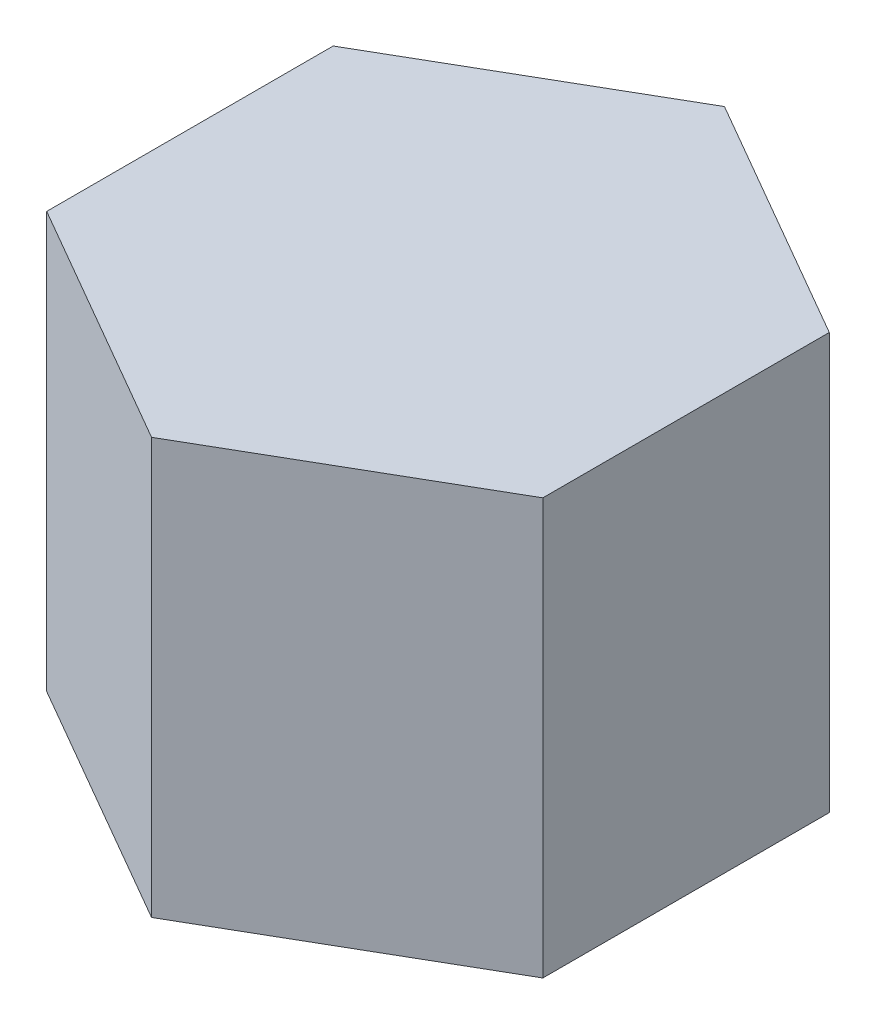
ISO-10303-21;
HEADER;
FILE_DESCRIPTION(('STEP AP214'),'2;1');
FILE_NAME('part.step','',(''),(''),'','','');
FILE_SCHEMA(('AUTOMOTIVE_DESIGN { 1 0 10303 214 1 1 1 1 }'));
ENDSEC;
DATA;
#1=APPLICATION_CONTEXT('core data for automotive mechanical design processes');
#2=APPLICATION_PROTOCOL_DEFINITION('international standard','automotive_design',2000,#1);
#3=PRODUCT_CONTEXT('',#1,'mechanical');
#4=PRODUCT('Part','Part','',(#3));
#5=PRODUCT_RELATED_PRODUCT_CATEGORY('part','',(#4));
#6=PRODUCT_DEFINITION_FORMATION('','',#4);
#7=PRODUCT_DEFINITION_CONTEXT('part definition',#1,'design');
#8=PRODUCT_DEFINITION('design','',#6,#7);
#9=PRODUCT_DEFINITION_SHAPE('','',#8);
#10=(LENGTH_UNIT() NAMED_UNIT(*) SI_UNIT(.MILLI.,.METRE.));
#11=(NAMED_UNIT(*) PLANE_ANGLE_UNIT() SI_UNIT($,.RADIAN.));
#12=(NAMED_UNIT(*) SI_UNIT($,.STERADIAN.) SOLID_ANGLE_UNIT());
#13=UNCERTAINTY_MEASURE_WITH_UNIT(LENGTH_MEASURE(1.E-05),#10,'distance_accuracy_value','');
#14=(GEOMETRIC_REPRESENTATION_CONTEXT(3) GLOBAL_UNCERTAINTY_ASSIGNED_CONTEXT((#13)) GLOBAL_UNIT_ASSIGNED_CONTEXT((#10,
#11,#12)) REPRESENTATION_CONTEXT('',''));
#15=CARTESIAN_POINT('',(0.,0.,0.));
#16=DIRECTION('',(0.,0.,1.));
#17=DIRECTION('',(1.,0.,0.));
#18=AXIS2_PLACEMENT_3D('',#15,#16,#17);
#19=CARTESIAN_POINT('',(209.642660308706,-148.537700895744,289.774920412926));
#20=DIRECTION('',(-0.499999999999943,0.,-0.866025403784472));
#21=DIRECTION('',(-0.866025403784472,0.,0.499999999999943));
#22=AXIS2_PLACEMENT_3D('',#19,#20,#21);
#23=PLANE('',#22);
#24=CARTESIAN_POINT('',(209.339551417382,-149.045793579175,289.949920412926));
#25=DIRECTION('',(0.866025403784471,0.,-0.499999999999943));
#26=VECTOR('',#25,1.);
#27=LINE('',#24,#26);
#28=CARTESIAN_POINT('',(209.339551417382,-149.045793579175,289.949920412926));
#29=VERTEX_POINT('',#28);
#30=CARTESIAN_POINT('',(209.642660308706,-149.045793579175,289.774920412926));
#31=VERTEX_POINT('',#30);
#32=EDGE_CURVE('E170',#29,#31,#27,.T.);
#33=ORIENTED_EDGE('',*,*,#32,.T.);
#34=CARTESIAN_POINT('',(209.642660308706,-148.537700895744,289.774920412926));
#35=DIRECTION('',(0.,-1.,0.));
#36=VECTOR('',#35,1.);
#37=LINE('',#34,#36);
#38=CARTESIAN_POINT('',(209.642660308706,-148.537700895744,289.774920412926));
#39=VERTEX_POINT('',#38);
#40=EDGE_CURVE('E35',#39,#31,#37,.T.);
#41=ORIENTED_EDGE('',*,*,#40,.F.);
#42=CARTESIAN_POINT('',(209.339551417382,-148.537700895744,289.949920412926));
#43=DIRECTION('',(0.866025403784471,0.,-0.499999999999943));
#44=VECTOR('',#43,1.);
#45=LINE('',#42,#44);
#46=CARTESIAN_POINT('',(209.339551417382,-148.537700895744,289.949920412926));
#47=VERTEX_POINT('',#46);
#48=EDGE_CURVE('E159',#47,#39,#45,.T.);
#49=ORIENTED_EDGE('',*,*,#48,.F.);
#50=CARTESIAN_POINT('',(209.339551417382,-148.537700895744,289.949920412926));
#51=DIRECTION('',(0.,-1.,0.));
#52=VECTOR('',#51,1.);
#53=LINE('',#50,#52);
#54=EDGE_CURVE('E10',#47,#29,#53,.T.);
#55=ORIENTED_EDGE('',*,*,#54,.T.);
#56=EDGE_LOOP('',(#33,#41,#49,#55));
#57=FACE_BOUND('',#56,.T.);
#58=ADVANCED_FACE('F16',(#57),#23,.F.);
#59=CARTESIAN_POINT('',(209.339551417382,-148.537700895744,289.949920412926));
#60=DIRECTION('',(0.500000000000062,0.,-0.866025403784403));
#61=DIRECTION('',(-0.866025403784403,0.,-0.500000000000062));
#62=AXIS2_PLACEMENT_3D('',#59,#60,#61);
#63=PLANE('',#62);
#64=CARTESIAN_POINT('',(209.036442526057,-149.045793579175,289.774920412926));
#65=DIRECTION('',(0.866025403784403,0.,0.500000000000062));
#66=VECTOR('',#65,1.);
#67=LINE('',#64,#66);
#68=CARTESIAN_POINT('',(209.036442526057,-149.045793579175,289.774920412926));
#69=VERTEX_POINT('',#68);
#70=EDGE_CURVE('E167',#69,#29,#67,.T.);
#71=ORIENTED_EDGE('',*,*,#70,.T.);
#72=ORIENTED_EDGE('',*,*,#54,.F.);
#73=CARTESIAN_POINT('',(209.036442526057,-148.537700895744,289.774920412926));
#74=DIRECTION('',(0.866025403784403,0.,0.500000000000062));
#75=VECTOR('',#74,1.);
#76=LINE('',#73,#75);
#77=CARTESIAN_POINT('',(209.036442526057,-148.537700895744,289.774920412926));
#78=VERTEX_POINT('',#77);
#79=EDGE_CURVE('E156',#78,#47,#76,.T.);
#80=ORIENTED_EDGE('',*,*,#79,.F.);
#81=CARTESIAN_POINT('',(209.036442526057,-148.537700895744,289.774920412926));
#82=DIRECTION('',(0.,-1.,0.));
#83=VECTOR('',#82,1.);
#84=LINE('',#81,#83);
#85=EDGE_CURVE('E27',#78,#69,#84,.T.);
#86=ORIENTED_EDGE('',*,*,#85,.T.);
#87=EDGE_LOOP('',(#71,#72,#80,#86));
#88=FACE_BOUND('',#87,.T.);
#89=ADVANCED_FACE('F189',(#88),#63,.F.);
#90=CARTESIAN_POINT('',(209.036442526057,-148.537700895744,290.831971220494));
#91=DIRECTION('',(1.,0.,0.));
#92=DIRECTION('',(0.,1.,0.));
#93=AXIS2_PLACEMENT_3D('',#90,#91,#92);
#94=PLANE('',#93);
#95=CARTESIAN_POINT('',(209.036442526057,-149.045793579175,289.424920412926));
#96=DIRECTION('',(0.,0.,1.));
#97=VECTOR('',#96,1.);
#98=LINE('',#95,#97);
#99=CARTESIAN_POINT('',(209.036442526057,-149.045793579175,289.424920412926));
#100=VERTEX_POINT('',#99);
#101=EDGE_CURVE('E163',#100,#69,#98,.T.);
#102=ORIENTED_EDGE('',*,*,#101,.T.);
#103=ORIENTED_EDGE('',*,*,#85,.F.);
#104=CARTESIAN_POINT('',(209.036442526057,-148.537700895744,289.424920412926));
#105=DIRECTION('',(0.,0.,1.));
#106=VECTOR('',#105,1.);
#107=LINE('',#104,#106);
#108=CARTESIAN_POINT('',(209.036442526057,-148.537700895744,289.424920412926));
#109=VERTEX_POINT('',#108);
#110=EDGE_CURVE('E106',#109,#78,#107,.T.);
#111=ORIENTED_EDGE('',*,*,#110,.F.);
#112=CARTESIAN_POINT('',(209.036442526057,-148.537700895744,289.424920412926));
#113=DIRECTION('',(0.,-1.,0.));
#114=VECTOR('',#113,1.);
#115=LINE('',#112,#114);
#116=EDGE_CURVE('E94',#109,#100,#115,.T.);
#117=ORIENTED_EDGE('',*,*,#116,.T.);
#118=EDGE_LOOP('',(#102,#103,#111,#117));
#119=FACE_BOUND('',#118,.T.);
#120=ADVANCED_FACE('F198',(#119),#94,.F.);
#121=CARTESIAN_POINT('',(209.036442526057,-148.537700895744,289.424920412926));
#122=DIRECTION('',(0.499999999999978,0.,0.866025403784452));
#123=DIRECTION('',(0.866025403784452,0.,-0.499999999999978));
#124=AXIS2_PLACEMENT_3D('',#121,#122,#123);
#125=PLANE('',#124);
#126=CARTESIAN_POINT('',(209.339551417382,-149.045793579175,289.249920412926));
#127=DIRECTION('',(-0.866025403784452,0.,0.499999999999978));
#128=VECTOR('',#127,1.);
#129=LINE('',#126,#128);
#130=CARTESIAN_POINT('',(209.339551417382,-149.045793579175,289.249920412926));
#131=VERTEX_POINT('',#130);
#132=EDGE_CURVE('E162',#131,#100,#129,.T.);
#133=ORIENTED_EDGE('',*,*,#132,.T.);
#134=ORIENTED_EDGE('',*,*,#116,.F.);
#135=CARTESIAN_POINT('',(209.339551417382,-148.537700895744,289.249920412926));
#136=DIRECTION('',(-0.866025403784452,0.,0.499999999999978));
#137=VECTOR('',#136,1.);
#138=LINE('',#135,#137);
#139=CARTESIAN_POINT('',(209.339551417382,-148.537700895744,289.249920412926));
#140=VERTEX_POINT('',#139);
#141=EDGE_CURVE('E98',#140,#109,#138,.T.);
#142=ORIENTED_EDGE('',*,*,#141,.F.);
#143=CARTESIAN_POINT('',(209.339551417382,-148.537700895744,289.249920412926));
#144=DIRECTION('',(0.,-1.,0.));
#145=VECTOR('',#144,1.);
#146=LINE('',#143,#145);
#147=EDGE_CURVE('E79',#140,#131,#146,.T.);
#148=ORIENTED_EDGE('',*,*,#147,.T.);
#149=EDGE_LOOP('',(#133,#134,#142,#148));
#150=FACE_BOUND('',#149,.T.);
#151=ADVANCED_FACE('F100',(#150),#125,.F.);
#152=CARTESIAN_POINT('',(209.339551417382,-148.537700895744,289.249920412926));
#153=DIRECTION('',(-0.499999999999943,0.,0.866025403784472));
#154=DIRECTION('',(0.866025403784472,0.,0.499999999999943));
#155=AXIS2_PLACEMENT_3D('',#152,#153,#154);
#156=PLANE('',#155);
#157=CARTESIAN_POINT('',(209.642660308706,-149.045793579175,289.424920412926));
#158=DIRECTION('',(-0.866025403784471,0.,-0.499999999999943));
#159=VECTOR('',#158,1.);
#160=LINE('',#157,#159);
#161=CARTESIAN_POINT('',(209.642660308706,-149.045793579175,289.424920412926));
#162=VERTEX_POINT('',#161);
#163=EDGE_CURVE('E88',#162,#131,#160,.T.);
#164=ORIENTED_EDGE('',*,*,#163,.T.);
#165=ORIENTED_EDGE('',*,*,#147,.F.);
#166=CARTESIAN_POINT('',(209.642660308706,-148.537700895744,289.424920412926));
#167=DIRECTION('',(-0.866025403784471,0.,-0.499999999999943));
#168=VECTOR('',#167,1.);
#169=LINE('',#166,#168);
#170=CARTESIAN_POINT('',(209.642660308706,-148.537700895744,289.424920412926));
#171=VERTEX_POINT('',#170);
#172=EDGE_CURVE('E84',#171,#140,#169,.T.);
#173=ORIENTED_EDGE('',*,*,#172,.F.);
#174=CARTESIAN_POINT('',(209.642660308706,-148.537700895744,289.424920412926));
#175=DIRECTION('',(0.,-1.,0.));
#176=VECTOR('',#175,1.);
#177=LINE('',#174,#176);
#178=EDGE_CURVE('E58',#171,#162,#177,.T.);
#179=ORIENTED_EDGE('',*,*,#178,.T.);
#180=EDGE_LOOP('',(#164,#165,#173,#179));
#181=FACE_BOUND('',#180,.T.);
#182=ADVANCED_FACE('F82',(#181),#156,.F.);
#183=CARTESIAN_POINT('',(209.642660308706,-148.537700895744,290.831971220494));
#184=DIRECTION('',(-1.,0.,0.));
#185=DIRECTION('',(0.,-1.,0.));
#186=AXIS2_PLACEMENT_3D('',#183,#184,#185);
#187=PLANE('',#186);
#188=CARTESIAN_POINT('',(209.642660308706,-149.045793579175,289.774920412926));
#189=DIRECTION('',(0.,0.,-1.));
#190=VECTOR('',#189,1.);
#191=LINE('',#188,#190);
#192=EDGE_CURVE('E160',#31,#162,#191,.T.);
#193=ORIENTED_EDGE('',*,*,#192,.T.);
#194=ORIENTED_EDGE('',*,*,#178,.F.);
#195=CARTESIAN_POINT('',(209.642660308706,-148.537700895744,289.774920412926));
#196=DIRECTION('',(0.,0.,-1.));
#197=VECTOR('',#196,1.);
#198=LINE('',#195,#197);
#199=EDGE_CURVE('E112',#39,#171,#198,.T.);
#200=ORIENTED_EDGE('',*,*,#199,.F.);
#201=ORIENTED_EDGE('',*,*,#40,.T.);
#202=EDGE_LOOP('',(#193,#194,#200,#201));
#203=FACE_BOUND('',#202,.T.);
#204=ADVANCED_FACE('F131',(#203),#187,.F.);
#205=CARTESIAN_POINT('',(206.339551417382,-148.537700895744,290.831971220494));
#206=DIRECTION('',(0.,-1.,0.));
#207=DIRECTION('',(1.,0.,0.));
#208=AXIS2_PLACEMENT_3D('',#205,#206,#207);
#209=PLANE('',#208);
#210=ORIENTED_EDGE('',*,*,#48,.T.);
#211=ORIENTED_EDGE('',*,*,#199,.T.);
#212=ORIENTED_EDGE('',*,*,#172,.T.);
#213=ORIENTED_EDGE('',*,*,#141,.T.);
#214=ORIENTED_EDGE('',*,*,#110,.T.);
#215=ORIENTED_EDGE('',*,*,#79,.T.);
#216=EDGE_LOOP('',(#210,#211,#212,#213,#214,#215));
#217=FACE_BOUND('',#216,.T.);
#218=ADVANCED_FACE('F111',(#217),#209,.F.);
#219=CARTESIAN_POINT('',(206.339551417382,-149.045793579175,290.831971220494));
#220=DIRECTION('',(0.,-1.,0.));
#221=DIRECTION('',(1.,0.,0.));
#222=AXIS2_PLACEMENT_3D('',#219,#220,#221);
#223=PLANE('',#222);
#224=ORIENTED_EDGE('',*,*,#32,.F.);
#225=ORIENTED_EDGE('',*,*,#70,.F.);
#226=ORIENTED_EDGE('',*,*,#101,.F.);
#227=ORIENTED_EDGE('',*,*,#132,.F.);
#228=ORIENTED_EDGE('',*,*,#163,.F.);
#229=ORIENTED_EDGE('',*,*,#192,.F.);
#230=EDGE_LOOP('',(#224,#225,#226,#227,#228,#229));
#231=FACE_BOUND('',#230,.T.);
#232=ADVANCED_FACE('F130',(#231),#223,.T.);
#233=CLOSED_SHELL('',(#58,#89,#120,#151,#182,#204,#218,#232));
#234=MANIFOLD_SOLID_BREP('B1',#233);
#235=ADVANCED_BREP_SHAPE_REPRESENTATION('',(#18,#234),#14);
#236=SHAPE_DEFINITION_REPRESENTATION(#9,#235);
ENDSEC;
END-ISO-10303-21;
